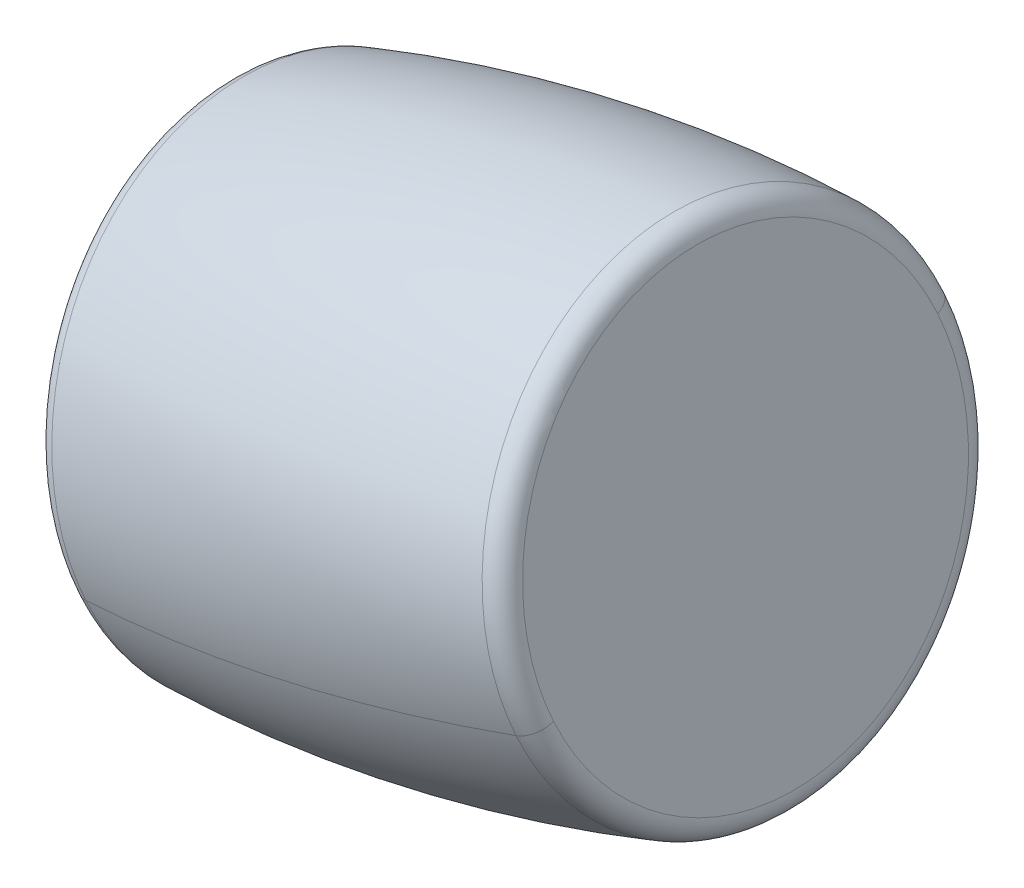
ISO-10303-21;
HEADER;
FILE_DESCRIPTION(('STEP AP214'),'2;1');
FILE_NAME('part.step','',(''),(''),'','','');
FILE_SCHEMA(('AUTOMOTIVE_DESIGN { 1 0 10303 214 1 1 1 1 }'));
ENDSEC;
DATA;
#1=APPLICATION_CONTEXT('core data for automotive mechanical design processes');
#2=APPLICATION_PROTOCOL_DEFINITION('international standard','automotive_design',2000,#1);
#3=PRODUCT_CONTEXT('',#1,'mechanical');
#4=PRODUCT('Part','Part','',(#3));
#5=PRODUCT_RELATED_PRODUCT_CATEGORY('part','',(#4));
#6=PRODUCT_DEFINITION_FORMATION('','',#4);
#7=PRODUCT_DEFINITION_CONTEXT('part definition',#1,'design');
#8=PRODUCT_DEFINITION('design','',#6,#7);
#9=PRODUCT_DEFINITION_SHAPE('','',#8);
#10=(LENGTH_UNIT() NAMED_UNIT(*) SI_UNIT(.MILLI.,.METRE.));
#11=(NAMED_UNIT(*) PLANE_ANGLE_UNIT() SI_UNIT($,.RADIAN.));
#12=(NAMED_UNIT(*) SI_UNIT($,.STERADIAN.) SOLID_ANGLE_UNIT());
#13=UNCERTAINTY_MEASURE_WITH_UNIT(LENGTH_MEASURE(1.E-05),#10,'distance_accuracy_value','');
#14=(GEOMETRIC_REPRESENTATION_CONTEXT(3) GLOBAL_UNCERTAINTY_ASSIGNED_CONTEXT((#13)) GLOBAL_UNIT_ASSIGNED_CONTEXT((#10,
#11,#12)) REPRESENTATION_CONTEXT('',''));
#15=CARTESIAN_POINT('',(0.,0.,0.));
#16=DIRECTION('',(0.,0.,1.));
#17=DIRECTION('',(1.,0.,0.));
#18=AXIS2_PLACEMENT_3D('',#15,#16,#17);
#19=CARTESIAN_POINT('',(5.41216295752265,92.374599006154,0.));
#20=DIRECTION('',(0.975020426816809,0.222115211748245,0.));
#21=DIRECTION('',(-0.222115211748245,0.975020426816809,0.));
#22=AXIS2_PLACEMENT_3D('',#19,#20,#21);
#23=PLANE('',#22);
#24=CARTESIAN_POINT('',(6.44112984304528,87.8577371307061,14.2576207137991));
#25=CARTESIAN_POINT('',(6.49294745993183,87.6302730388247,14.1818251436068));
#26=CARTESIAN_POINT('',(6.54435105352382,87.4046263873887,14.1002941965974));
#27=CARTESIAN_POINT('',(6.64620816349415,86.9575036439444,13.9259793446168));
#28=CARTESIAN_POINT('',(6.69666167987248,86.7360275519361,13.8331954396454));
#29=CARTESIAN_POINT('',(6.79649660479089,86.2977816058839,13.6365924674124));
#30=CARTESIAN_POINT('',(6.84587801333098,86.0810117518402,13.5327734001508));
#31=CARTESIAN_POINT('',(6.94344988803728,85.652699930364,13.3143517476132));
#32=CARTESIAN_POINT('',(6.99164035420349,85.4411579629316,13.1997491623373));
#33=CARTESIAN_POINT('',(7.08671421438109,85.0238116902479,12.9600361501216));
#34=CARTESIAN_POINT('',(7.13359760839247,84.8180073849966,12.834925723182));
#35=CARTESIAN_POINT('',(7.22594438736281,84.4126321964261,12.5744985398274));
#36=CARTESIAN_POINT('',(7.27140777232175,84.213061313107,12.4391817834126));
#37=CARTESIAN_POINT('',(7.36080500541744,83.820633763084,12.1586679014951));
#38=CARTESIAN_POINT('',(7.40473885355418,83.6277770963802,12.0134707759924));
#39=CARTESIAN_POINT('',(7.4909711731852,83.2492425852574,11.7135459564053));
#40=CARTESIAN_POINT('',(7.53326964467949,83.0635647408386,11.5588182623209));
#41=CARTESIAN_POINT('',(7.61612931012387,82.6998351892622,11.2402050560175));
#42=CARTESIAN_POINT('',(7.65669050407397,82.5217834821047,11.0763195437985));
#43=CARTESIAN_POINT('',(7.73597789900895,82.1737351469987,10.7397855163479));
#44=CARTESIAN_POINT('',(7.77470409999385,82.0037385190501,10.5671370011162));
#45=CARTESIAN_POINT('',(7.8502282141754,81.6722098791849,10.2134928928833));
#46=CARTESIAN_POINT('',(7.88702612737205,81.5106778672684,10.0324972998821));
#47=CARTESIAN_POINT('',(7.95860501658456,81.1964676042173,9.6625950703877));
#48=CARTESIAN_POINT('',(7.99338599260042,81.0437893530828,9.47368843389457));
#49=CARTESIAN_POINT('',(8.06084721703273,80.7476544268801,9.08841921003909));
#50=CARTESIAN_POINT('',(8.09352746544919,80.6041977518118,8.89205662267673));
#51=CARTESIAN_POINT('',(8.15670850510206,80.3268515774359,8.49234855175799));
#52=CARTESIAN_POINT('',(8.18720929633847,80.1929620781282,8.28900306820161));
#53=CARTESIAN_POINT('',(8.24595794255356,79.9350728068051,7.87581908197489));
#54=CARTESIAN_POINT('',(8.27420579753223,79.8110730347896,7.66598057930456));
#55=CARTESIAN_POINT('',(8.32838051967497,79.5732619443625,7.24031607418276));
#56=CARTESIAN_POINT('',(8.35430738683905,79.4594506259509,7.02449007173129));
#57=CARTESIAN_POINT('',(8.40377767325868,79.2422906241663,6.5873705107912));
#58=CARTESIAN_POINT('',(8.42732109251423,79.1389419407934,6.36607695230258));
#59=CARTESIAN_POINT('',(8.47196776495767,78.9429561851168,5.91855539485362));
#60=CARTESIAN_POINT('',(8.49307101814555,78.8503191128131,5.69232739589328));
#61=CARTESIAN_POINT('',(8.5327865188683,78.6759797500961,5.23548196056561));
#62=CARTESIAN_POINT('',(8.55139876640316,78.5942774596829,5.00486452419828));
#63=CARTESIAN_POINT('',(8.58608741728531,78.4420044887206,4.53979579166054));
#64=CARTESIAN_POINT('',(8.6021638206326,78.3714338081717,4.30534449549013));
#65=CARTESIAN_POINT('',(8.6317420536758,78.2415940678888,3.83317285705422));
#66=CARTESIAN_POINT('',(8.64524388337172,78.1823250081548,3.59545251478871));
#67=CARTESIAN_POINT('',(8.66964044202184,78.0752312938582,3.11731547328896));
#68=CARTESIAN_POINT('',(8.68053517097603,78.0274066392955,2.87689877405471));
#69=CARTESIAN_POINT('',(8.69969128178638,77.9433169491233,2.39394820350396));
#70=CARTESIAN_POINT('',(8.70795266364254,77.9070519135137,2.15141433218745));
#71=CARTESIAN_POINT('',(8.72182217786431,77.8461688268948,1.66481370281162));
#72=CARTESIAN_POINT('',(8.72743031022992,77.8215507758854,1.4207469447523));
#73=CARTESIAN_POINT('',(8.73597981498852,77.7840209655082,0.931668520088751));
#74=CARTESIAN_POINT('',(8.7389211873815,77.7711092061404,0.686656853484513));
#75=CARTESIAN_POINT('',(8.74213008617112,77.7570230846053,0.196278866296461));
#76=CARTESIAN_POINT('',(8.74239761256775,77.7558487224382,-0.0490874542873532));
#77=CARTESIAN_POINT('',(8.74025817487014,77.7652402244459,-0.539583640476731));
#78=CARTESIAN_POINT('',(8.73785121077589,77.7758060886208,-0.784713506082293));
#79=CARTESIAN_POINT('',(8.73036859068385,77.8086525892203,-1.27414624299807));
#80=CARTESIAN_POINT('',(8.72529293468605,77.8309332256449,-1.51844911430829));
#81=CARTESIAN_POINT('',(8.71248515848679,77.8871555947393,-2.005639315618));
#82=CARTESIAN_POINT('',(8.70475303828532,77.921097327409,-2.24852664561749));
#83=CARTESIAN_POINT('',(8.68665096103352,78.0005601203866,-2.73230062745336));
#84=CARTESIAN_POINT('',(8.67628100398319,78.0460811806944,-2.97318727928973));
#85=CARTESIAN_POINT('',(8.65292823516852,78.1485929647268,-3.4523795877559));
#86=CARTESIAN_POINT('',(8.63994542340417,78.2055836884513,-3.69068524438569));
#87=CARTESIAN_POINT('',(8.61139822189216,78.3308975036717,-4.16414146323879));
#88=CARTESIAN_POINT('',(8.59583383214449,78.3992205951676,-4.3992920254621));
#89=CARTESIAN_POINT('',(8.56216097064402,78.5470345496191,-4.86587155720104));
#90=CARTESIAN_POINT('',(8.54405249889121,78.6265254125747,-5.09730052671669));
#91=CARTESIAN_POINT('',(8.50533509827502,78.7964834094939,-5.55587934038198));
#92=CARTESIAN_POINT('',(8.48472616941165,78.8869505434577,-5.78302918453162));
#93=CARTESIAN_POINT('',(8.44105750328908,79.0786431391436,-6.23250252359438));
#94=CARTESIAN_POINT('',(8.41799776602989,79.1798686008657,-6.45482601850749));
#95=CARTESIAN_POINT('',(8.36948303604255,79.392833991065,-6.89411106232469));
#96=CARTESIAN_POINT('',(8.34402804331441,79.5045739195421,-7.11107261122878));
#97=CARTESIAN_POINT('',(8.29078412569623,79.7382990519761,-7.53911108365306));
#98=CARTESIAN_POINT('',(8.26299520080619,79.8602842559331,-7.75018800717323));
#99=CARTESIAN_POINT('',(8.20515036481833,80.114206066286,-8.16594872603276));
#100=CARTESIAN_POINT('',(8.1750944537205,80.2461426726819,-8.37063252137211));
#101=CARTESIAN_POINT('',(8.11278805263946,80.5196494410716,-8.77311388267882));
#102=CARTESIAN_POINT('',(8.08053756265625,80.6612196030654,-8.97091144864618));
#103=CARTESIAN_POINT('',(8.01391969805963,80.9536524277305,-9.35914383954748));
#104=CARTESIAN_POINT('',(7.97955232344622,81.1045150904018,-9.54957866448142));
#105=CARTESIAN_POINT('',(7.90878348360488,81.4151694750535,-9.92262679914249));
#106=CARTESIAN_POINT('',(7.87238201837694,81.574961197034,-10.1052401088696));
#107=CARTESIAN_POINT('',(7.79763269162465,81.9030887480497,-10.4622052816589));
#108=CARTESIAN_POINT('',(7.75928483010031,82.0714245770849,-10.6365571447211));
#109=CARTESIAN_POINT('',(7.68073509411251,82.4162348064535,-10.9765793952709));
#110=CARTESIAN_POINT('',(7.64053321964905,82.5927092067869,-11.1422497827585));
#111=CARTESIAN_POINT('',(7.55837230761987,82.9533714364641,-11.4645099676848));
#112=CARTESIAN_POINT('',(7.51641327005414,83.137559265808,-11.6210997651234));
#113=CARTESIAN_POINT('',(7.4308391148171,83.5132046288922,-11.9248215314141));
#114=CARTESIAN_POINT('',(7.38722399714579,83.7046621626326,-12.0719535002661));
#115=CARTESIAN_POINT('',(7.29844275433627,84.0943856965416,-12.3564051555832));
#116=CARTESIAN_POINT('',(7.25327662919807,84.2926516967101,-12.4937248420483));
#117=CARTESIAN_POINT('',(7.16150218060632,84.6955145233149,-12.7582211174393));
#118=CARTESIAN_POINT('',(7.11489385715277,84.9001113497511,-12.8853977063651));
#119=CARTESIAN_POINT('',(7.02034729546393,85.3151429372157,-13.1293014071352));
#120=CARTESIAN_POINT('',(6.97240905722864,85.5255776982441,-13.2460285189796));
#121=CARTESIAN_POINT('',(6.87531815339114,85.9517781991218,-13.4687520597504));
#122=CARTESIAN_POINT('',(6.82616548778891,86.1675439389712,-13.5747484886768));
#123=CARTESIAN_POINT('',(6.72676414229423,86.6038865989249,-13.7757553089303));
#124=CARTESIAN_POINT('',(6.67651546240177,86.8244635190291,-13.8707657002574));
#125=CARTESIAN_POINT('',(6.57504314179775,87.2698971503715,-14.0495715569573));
#126=CARTESIAN_POINT('',(6.5238195010862,87.4947538616098,-14.1333670223301));
#127=CARTESIAN_POINT('',(6.42052066108107,87.948205375708,-14.2895411565067));
#128=CARTESIAN_POINT('',(6.36844546178749,88.1768001785679,-14.3619198253104));
#129=CARTESIAN_POINT('',(6.26356895833487,88.6371771710062,-14.495085999793));
#130=CARTESIAN_POINT('',(6.21076765417582,88.8689593605844,-14.5558735054718));
#131=CARTESIAN_POINT('',(6.10456614395811,89.3351527428658,-14.6657109112904));
#132=CARTESIAN_POINT('',(6.05116593789946,89.5695639355689,-14.71476081143));
#133=CARTESIAN_POINT('',(5.9438952696588,90.0404506069936,-14.8010048406224));
#134=CARTESIAN_POINT('',(5.89002480747679,90.2769260857153,-14.8381989696752));
#135=CARTESIAN_POINT('',(5.78194340564183,90.7513716390775,-14.9006418529361));
#136=CARTESIAN_POINT('',(5.72773246598888,90.9893417137182,-14.9258906071443));
#137=CARTESIAN_POINT('',(5.61910070814935,91.4662031680099,-14.9643819136692));
#138=CARTESIAN_POINT('',(5.56467988996276,91.7050945476608,-14.9776244659859));
#139=CARTESIAN_POINT('',(5.45575947944169,92.1832231022944,-14.9920714684485));
#140=CARTESIAN_POINT('',(5.4012598871072,92.422460277277,-14.9932759185943));
#141=CARTESIAN_POINT('',(5.29231322307442,92.9007040771024,-14.9836438069197));
#142=CARTESIAN_POINT('',(5.23786615137614,93.1397107019452,-14.9728072450992));
#143=CARTESIAN_POINT('',(5.12915569454215,93.616917621667,-14.9391192462076));
#144=CARTESIAN_POINT('',(5.07489230940644,93.855117916546,-14.9162678091365));
#145=CARTESIAN_POINT('',(4.96667995780615,94.3301383008489,-14.8586049970701));
#146=CARTESIAN_POINT('',(4.91273099134156,94.5669583902728,-14.8237936220748));
#147=CARTESIAN_POINT('',(4.80527741926409,95.0386479557255,-14.7422952224707));
#148=CARTESIAN_POINT('',(4.75177281365122,95.2735174317542,-14.6956081978619));
#149=CARTESIAN_POINT('',(4.64533695611764,95.7407395298005,-14.5904693873124));
#150=CARTESIAN_POINT('',(4.59240570419693,95.973092151818,-14.5320176013717));
#151=CARTESIAN_POINT('',(4.48724371343849,96.43472234953,-14.4034959983713));
#152=CARTESIAN_POINT('',(4.43501297460076,96.6639999252246,-14.3334261813117));
#153=CARTESIAN_POINT('',(4.38319607199993,96.8914608816018,-14.2576207137991));
#154=B_SPLINE_CURVE_WITH_KNOTS('',3,(#24,#25,#26,#27,#28,#29,#30,#31,#32,#33,#34,#35,#36,#37,
#38,#39,#40,#41,#42,#43,#44,#45,#46,#47,#48,#49,#50,#51,#52,#53,#54,#55,#56,#57,#58,#59,#60,#61,
#62,#63,#64,#65,#66,#67,#68,#69,#70,#71,#72,#73,#74,#75,#76,#77,#78,#79,#80,#81,#82,#83,#84,#85,
#86,#87,#88,#89,#90,#91,#92,#93,#94,#95,#96,#97,#98,#99,#100,#101,#102,#103,#104,#105,#106,#107,
#108,#109,#110,#111,#112,#113,#114,#115,#116,#117,#118,#119,#120,#121,#122,#123,#124,#125,#126,
#127,#128,#129,#130,#131,#132,#133,#134,#135,#136,#137,#138,#139,#140,#141,#142,#143,#144,#145,
#146,#147,#148,#149,#150,#151,#152,#153),.UNSPECIFIED.,.F.,.F.,(4,2,2,2,2,2,2,2,2,2,2,2,2,2,2,2,
2,2,2,2,2,2,2,2,2,2,2,2,2,2,2,2,2,2,2,2,2,2,2,2,2,2,2,2,2,2,2,2,2,2,2,2,2,2,2,2,2,2,2,2,2,2,2,2,
4),(0.,0.735812272215711,1.47162454443143,2.20743681664715,2.94324908886287,3.67906136107858,
4.4148736332943,5.15068590551002,5.88649817772574,6.62231044994146,7.35812272215718,
8.0939349943729,8.82974726658862,9.56555953880433,10.3013718110201,11.0371840832358,
11.7729963554515,12.5088086276672,13.2446208998829,13.9804331720987,14.7162454443144,
15.4520577165301,16.1878699887458,16.9236822609615,17.6594945331772,18.395306805393,
19.1311190776087,19.8669313498244,20.6027436220401,21.3385558942558,22.0743681664716,
22.8101804386873,23.545992710903,24.2818049831187,25.0176172553344,25.7534295275501,
26.4892417997659,27.2250540719816,27.9608663441973,28.696678616413,29.4324908886287,
30.1683031608445,30.9041154330602,31.6399277052759,32.3757399774916,33.1115522497073,
33.8473645219231,34.5831767941388,35.3189890663545,36.0548013385702,36.7906136107859,
37.5264258830016,38.2622381552174,38.9980504274331,39.7338626996488,40.4696749718645,
41.2054872440802,41.9412995162959,42.6771117885116,43.4129240607274,44.1487363329431,
44.8845486051588,45.6203608773745,46.3561731495902,47.091985421806),.UNSPECIFIED.);
#155=CARTESIAN_POINT('',(6.44112984304528,87.8577371307061,14.2576207137991));
#156=VERTEX_POINT('',#155);
#157=CARTESIAN_POINT('',(4.38319607199992,96.8914608816019,-14.2576207137991));
#158=VERTEX_POINT('',#157);
#159=EDGE_CURVE('E11',#156,#158,#154,.T.);
#160=ORIENTED_EDGE('',*,*,#159,.F.);
#161=CARTESIAN_POINT('',(4.38319607199992,96.8914608816019,-14.2576207137991));
#162=CARTESIAN_POINT('',(4.33137845511338,97.1189249734832,-14.1818251436068));
#163=CARTESIAN_POINT('',(4.27997486152138,97.3445716249192,-14.1002941965974));
#164=CARTESIAN_POINT('',(4.17811775155105,97.7916943683636,-13.9259793446168));
#165=CARTESIAN_POINT('',(4.12766423517272,98.0131704603719,-13.8331954396454));
#166=CARTESIAN_POINT('',(4.02782931025431,98.451416406424,-13.6365924674124));
#167=CARTESIAN_POINT('',(3.97844790171422,98.6681862604678,-13.5327734001508));
#168=CARTESIAN_POINT('',(3.88087602700793,99.0964980819439,-13.3143517476132));
#169=CARTESIAN_POINT('',(3.83268556084171,99.3080400493763,-13.1997491623372));
#170=CARTESIAN_POINT('',(3.73761170066411,99.72538632206,-12.9600361501216));
#171=CARTESIAN_POINT('',(3.69072830665273,99.9311906273114,-12.834925723182));
#172=CARTESIAN_POINT('',(3.59838152768239,100.336565815882,-12.5744985398274));
#173=CARTESIAN_POINT('',(3.55291814272345,100.536136699201,-12.4391817834126));
#174=CARTESIAN_POINT('',(3.46352090962776,100.928564249224,-12.1586679014951));
#175=CARTESIAN_POINT('',(3.41958706149102,101.121420915928,-12.0134707759924));
#176=CARTESIAN_POINT('',(3.33335474186,101.499955427051,-11.7135459564053));
#177=CARTESIAN_POINT('',(3.29105627036571,101.685633271469,-11.5588182623209));
#178=CARTESIAN_POINT('',(3.20819660492133,102.049362823046,-11.2402050560175));
#179=CARTESIAN_POINT('',(3.16763541097124,102.227414530203,-11.0763195437985));
#180=CARTESIAN_POINT('',(3.08834801603625,102.575462865309,-10.7397855163479));
#181=CARTESIAN_POINT('',(3.04962181505135,102.745459493258,-10.5671370011162));
#182=CARTESIAN_POINT('',(2.9740977008698,103.076988133123,-10.2134928928833));
#183=CARTESIAN_POINT('',(2.93729978767315,103.23852014504,-10.0324972998821));
#184=CARTESIAN_POINT('',(2.86572089846064,103.552730408091,-9.6625950703877));
#185=CARTESIAN_POINT('',(2.83093992244478,103.705408659225,-9.47368843389458));
#186=CARTESIAN_POINT('',(2.76347869801247,104.001543585428,-9.08841921003909));
#187=CARTESIAN_POINT('',(2.73079844959601,104.145000260496,-8.89205662267673));
#188=CARTESIAN_POINT('',(2.66761740994314,104.422346434872,-8.49234855175799));
#189=CARTESIAN_POINT('',(2.63711661870672,104.55623593418,-8.28900306820162));
#190=CARTESIAN_POINT('',(2.57836797249164,104.814125205503,-7.8758190819749));
#191=CARTESIAN_POINT('',(2.55012011751297,104.938124977518,-7.66598057930457));
#192=CARTESIAN_POINT('',(2.49594539537023,105.175936067946,-7.24031607418277));
#193=CARTESIAN_POINT('',(2.47001852820615,105.289747386357,-7.0244900717313));
#194=CARTESIAN_POINT('',(2.42054824178652,105.506907388142,-6.58737051079121));
#195=CARTESIAN_POINT('',(2.39700482253097,105.610256071515,-6.36607695230259));
#196=CARTESIAN_POINT('',(2.35235815008753,105.806241827191,-5.91855539485362));
#197=CARTESIAN_POINT('',(2.33125489689965,105.898878899495,-5.69232739589329));
#198=CARTESIAN_POINT('',(2.2915393961769,106.073218262212,-5.23548196056562));
#199=CARTESIAN_POINT('',(2.27292714864204,106.154920552625,-5.00486452419829));
#200=CARTESIAN_POINT('',(2.23823849775989,106.307193523587,-4.53979579166055));
#201=CARTESIAN_POINT('',(2.2221620944126,106.377764204136,-4.30534449549015));
#202=CARTESIAN_POINT('',(2.1925838613694,106.507603944419,-3.83317285705423));
#203=CARTESIAN_POINT('',(2.17908203167348,106.566873004153,-3.59545251478872));
#204=CARTESIAN_POINT('',(2.15468547302336,106.67396671845,-3.11731547328897));
#205=CARTESIAN_POINT('',(2.14379074406917,106.721791373012,-2.87689877405473));
#206=CARTESIAN_POINT('',(2.12463463325882,106.805881063185,-2.39394820350397));
#207=CARTESIAN_POINT('',(2.11637325140266,106.842146098794,-2.15141433218746));
#208=CARTESIAN_POINT('',(2.10250373718089,106.903029185413,-1.66481370281164));
#209=CARTESIAN_POINT('',(2.09689560481528,106.927647236423,-1.42074694475232));
#210=CARTESIAN_POINT('',(2.08834610005668,106.9651770468,-0.931668520088765));
#211=CARTESIAN_POINT('',(2.0854047276637,106.978088806168,-0.686656853484527));
#212=CARTESIAN_POINT('',(2.08219582887408,106.992174927703,-0.196278866296472));
#213=CARTESIAN_POINT('',(2.08192830247745,106.99334928987,0.049087454287344));
#214=CARTESIAN_POINT('',(2.08406774017507,106.983957787862,0.539583640476721));
#215=CARTESIAN_POINT('',(2.08647470426931,106.973391923687,0.784713506082281));
#216=CARTESIAN_POINT('',(2.09395732436135,106.940545423088,1.27414624299806));
#217=CARTESIAN_POINT('',(2.09903298035915,106.918264786663,1.51844911430828));
#218=CARTESIAN_POINT('',(2.11184075655841,106.862042417569,2.00563931561799));
#219=CARTESIAN_POINT('',(2.11957287675988,106.828100684899,2.24852664561747));
#220=CARTESIAN_POINT('',(2.13767495401168,106.748637891921,2.73230062745333));
#221=CARTESIAN_POINT('',(2.14804491106201,106.703116831614,2.97318727928971));
#222=CARTESIAN_POINT('',(2.17139767987668,106.600605047581,3.45237958775588));
#223=CARTESIAN_POINT('',(2.18438049164102,106.543614323857,3.69068524438568));
#224=CARTESIAN_POINT('',(2.21292769315304,106.418300508636,4.16414146323878));
#225=CARTESIAN_POINT('',(2.22849208290071,106.34997741714,4.39929202546208));
#226=CARTESIAN_POINT('',(2.26216494440118,106.202163462689,4.86587155720103));
#227=CARTESIAN_POINT('',(2.28027341615399,106.122672599733,5.09730052671667));
#228=CARTESIAN_POINT('',(2.31899081677017,105.952714602814,5.55587934038196));
#229=CARTESIAN_POINT('',(2.33959974563355,105.86224746885,5.78302918453161));
#230=CARTESIAN_POINT('',(2.38326841175612,105.670554873164,6.23250252359436));
#231=CARTESIAN_POINT('',(2.40632814901531,105.569329411442,6.45482601850748));
#232=CARTESIAN_POINT('',(2.45484287900264,105.356364021243,6.89411106232468));
#233=CARTESIAN_POINT('',(2.48029787173079,105.244624092766,7.11107261122877));
#234=CARTESIAN_POINT('',(2.53354178934897,105.010898960332,7.53911108365304));
#235=CARTESIAN_POINT('',(2.561330714239,104.888913756375,7.75018800717322));
#236=CARTESIAN_POINT('',(2.61917555022686,104.634991946022,8.16594872603274));
#237=CARTESIAN_POINT('',(2.64923146132469,104.503055339626,8.37063252137209));
#238=CARTESIAN_POINT('',(2.71153786240573,104.229548571236,8.7731138826788));
#239=CARTESIAN_POINT('',(2.74378835238894,104.087978409243,8.97091144864616));
#240=CARTESIAN_POINT('',(2.81040621698556,103.795545584577,9.35914383954746));
#241=CARTESIAN_POINT('',(2.84477359159897,103.644682921906,9.5495786644814));
#242=CARTESIAN_POINT('',(2.91554243144032,103.334028537254,9.92262679914247));
#243=CARTESIAN_POINT('',(2.95194389666826,103.174236815274,10.1052401088696));
#244=CARTESIAN_POINT('',(3.02669322342054,102.846109264258,10.4622052816589));
#245=CARTESIAN_POINT('',(3.06504108494489,102.677773435223,10.636557144721));
#246=CARTESIAN_POINT('',(3.14359082093269,102.332963205854,10.9765793952708));
#247=CARTESIAN_POINT('',(3.18379269539615,102.156488805521,11.1422497827585));
#248=CARTESIAN_POINT('',(3.26595360742533,101.795826575844,11.4645099676848));
#249=CARTESIAN_POINT('',(3.30791264499105,101.6116387465,11.6210997651234));
#250=CARTESIAN_POINT('',(3.39348680022809,101.235993383416,11.9248215314141));
#251=CARTESIAN_POINT('',(3.43710191789941,101.044535849675,12.0719535002661));
#252=CARTESIAN_POINT('',(3.52588316070892,100.654812315766,12.3564051555832));
#253=CARTESIAN_POINT('',(3.57104928584713,100.456546315598,12.4937248420483));
#254=CARTESIAN_POINT('',(3.66282373443888,100.053683488993,12.7582211174393));
#255=CARTESIAN_POINT('',(3.70943205789243,99.8490866625569,12.885397706365));
#256=CARTESIAN_POINT('',(3.80397861958126,99.4340550750923,13.1293014071352));
#257=CARTESIAN_POINT('',(3.85191685781655,99.2236203140639,13.2460285189796));
#258=CARTESIAN_POINT('',(3.94900776165406,98.7974198131861,13.4687520597504));
#259=CARTESIAN_POINT('',(3.99816042725628,98.5816540733368,13.5747484886768));
#260=CARTESIAN_POINT('',(4.09756177275096,98.1453114133831,13.7757553089303));
#261=CARTESIAN_POINT('',(4.14781045264342,97.9247344932789,13.8707657002574));
#262=CARTESIAN_POINT('',(4.24928277324744,97.4793008619364,14.0495715569573));
#263=CARTESIAN_POINT('',(4.300506413959,97.2544441506982,14.1333670223301));
#264=CARTESIAN_POINT('',(4.40380525396413,96.8009926366,14.2895411565067));
#265=CARTESIAN_POINT('',(4.4558804532577,96.57239783374,14.3619198253104));
#266=CARTESIAN_POINT('',(4.56075695671032,96.1120208413018,14.495085999793));
#267=CARTESIAN_POINT('',(4.61355826086938,95.8802386517236,14.5558735054718));
#268=CARTESIAN_POINT('',(4.71975977108709,95.4140452694422,14.6657109112904));
#269=CARTESIAN_POINT('',(4.77315997714574,95.1796340767391,14.71476081143));
#270=CARTESIAN_POINT('',(4.8804306453864,94.7087474053143,14.8010048406224));
#271=CARTESIAN_POINT('',(4.93430110756841,94.4722719265927,14.8381989696751));
#272=CARTESIAN_POINT('',(5.04238250940336,93.9978263732304,14.9006418529361));
#273=CARTESIAN_POINT('',(5.09659344905631,93.7598562985897,14.9258906071443));
#274=CARTESIAN_POINT('',(5.20522520689584,93.2829948442981,14.9643819136692));
#275=CARTESIAN_POINT('',(5.25964602508243,93.0441034646472,14.9776244659859));
#276=CARTESIAN_POINT('',(5.36856643560351,92.5659749100136,14.9920714684485));
#277=CARTESIAN_POINT('',(5.423066027938,92.3267377350309,14.9932759185943));
#278=CARTESIAN_POINT('',(5.53201269197077,91.8484939352055,14.9836438069197));
#279=CARTESIAN_POINT('',(5.58645976366905,91.6094873103628,14.9728072450992));
#280=CARTESIAN_POINT('',(5.69517022050304,91.132280390641,14.9391192462076));
#281=CARTESIAN_POINT('',(5.74943360563875,90.894080095762,14.9162678091365));
#282=CARTESIAN_POINT('',(5.85764595723905,90.4190597114591,14.8586049970701));
#283=CARTESIAN_POINT('',(5.91159492370364,90.1822396220352,14.8237936220748));
#284=CARTESIAN_POINT('',(6.0190484957811,89.7105500565825,14.7422952224707));
#285=CARTESIAN_POINT('',(6.07255310139397,89.4756805805538,14.6956081978619));
#286=CARTESIAN_POINT('',(6.17898895892755,89.0084584825075,14.5904693873124));
#287=CARTESIAN_POINT('',(6.23192021084826,88.77610586049,14.5320176013717));
#288=CARTESIAN_POINT('',(6.3370822016067,88.314475662778,14.4034959983713));
#289=CARTESIAN_POINT('',(6.38931294044443,88.0851980870834,14.3334261813117));
#290=CARTESIAN_POINT('',(6.44112984304526,87.8577371307061,14.2576207137991));
#291=B_SPLINE_CURVE_WITH_KNOTS('',3,(#161,#162,#163,#164,#165,#166,#167,#168,#169,#170,#171,
#172,#173,#174,#175,#176,#177,#178,#179,#180,#181,#182,#183,#184,#185,#186,#187,#188,#189,#190,
#191,#192,#193,#194,#195,#196,#197,#198,#199,#200,#201,#202,#203,#204,#205,#206,#207,#208,#209,
#210,#211,#212,#213,#214,#215,#216,#217,#218,#219,#220,#221,#222,#223,#224,#225,#226,#227,#228,
#229,#230,#231,#232,#233,#234,#235,#236,#237,#238,#239,#240,#241,#242,#243,#244,#245,#246,#247,
#248,#249,#250,#251,#252,#253,#254,#255,#256,#257,#258,#259,#260,#261,#262,#263,#264,#265,#266,
#267,#268,#269,#270,#271,#272,#273,#274,#275,#276,#277,#278,#279,#280,#281,#282,#283,#284,#285,
#286,#287,#288,#289,#290),.UNSPECIFIED.,.F.,.F.,(4,2,2,2,2,2,2,2,2,2,2,2,2,2,2,2,2,2,2,2,2,2,2,
2,2,2,2,2,2,2,2,2,2,2,2,2,2,2,2,2,2,2,2,2,2,2,2,2,2,2,2,2,2,2,2,2,2,2,2,2,2,2,2,2,4),(0.,
0.735812272215724,1.47162454443143,2.20743681664716,2.94324908886287,3.67906136107859,
4.41487363329431,5.15068590551003,5.88649817772575,6.62231044994147,7.35812272215718,
8.0939349943729,8.82974726658862,9.56555953880433,10.3013718110201,11.0371840832358,
11.7729963554515,12.5088086276672,13.2446208998829,13.9804331720986,14.7162454443144,
15.4520577165301,16.1878699887458,16.9236822609615,17.6594945331772,18.395306805393,
19.1311190776087,19.8669313498244,20.6027436220401,21.3385558942558,22.0743681664715,
22.8101804386873,23.545992710903,24.2818049831187,25.0176172553344,25.7534295275501,
26.4892417997659,27.2250540719816,27.9608663441973,28.696678616413,29.4324908886287,
30.1683031608444,30.9041154330602,31.6399277052759,32.3757399774916,33.1115522497073,
33.847364521923,34.5831767941388,35.3189890663545,36.0548013385702,36.7906136107859,
37.5264258830016,38.2622381552173,38.9980504274331,39.7338626996488,40.4696749718645,
41.2054872440802,41.9412995162959,42.6771117885116,43.4129240607273,44.1487363329431,
44.8845486051588,45.6203608773745,46.3561731495902,47.0919854218059),.UNSPECIFIED.);
#292=EDGE_CURVE('E26',#158,#156,#291,.T.);
#293=ORIENTED_EDGE('',*,*,#292,.F.);
#294=EDGE_LOOP('',(#160,#293));
#295=FACE_BOUND('',#294,.T.);
#296=ADVANCED_FACE('F17',(#295),#23,.F.);
#297=CARTESIAN_POINT('',(6.87469359774891,92.7077718237766,0.));
#298=DIRECTION('',(0.975020426816809,0.222115211748245,0.));
#299=DIRECTION('',(0.211244119501446,-0.927299530445008,-0.309016994374947));
#300=AXIS2_PLACEMENT_3D('',#297,#298,#299);
#301=TOROIDAL_SURFACE('',#300,14.9913495880768,1.50000000000113);
#302=CARTESIAN_POINT('',(5.84572671222623,97.2246336992245,-14.2576207137991));
#303=DIRECTION('',(-0.211244119501447,0.927299530445008,0.309016994374946));
#304=DIRECTION('',(-0.198556513350396,0.268848322363584,-0.942494504264306));
#305=AXIS2_PLACEMENT_3D('',#302,#303,#304);
#306=CIRCLE('',#305,1.50000000000112);
#307=CARTESIAN_POINT('',(5.54789194220041,97.6279061827702,-15.6713624701966));
#308=VERTEX_POINT('',#307);
#309=EDGE_CURVE('E104',#308,#158,#306,.T.);
#310=ORIENTED_EDGE('',*,*,#309,.T.);
#311=ORIENTED_EDGE('',*,*,#292,.T.);
#312=CARTESIAN_POINT('',(7.90366048327159,88.1909099483287,14.2576207137991));
#313=DIRECTION('',(0.211244119501446,-0.927299530445008,-0.309016994374947));
#314=DIRECTION('',(-0.0625175971606157,-0.328322493102197,0.942494504264306));
#315=AXIS2_PLACEMENT_3D('',#312,#313,#314);
#316=CIRCLE('',#315,1.50000000000112);
#317=CARTESIAN_POINT('',(7.8098840875306,87.698426208675,15.6713624701966));
#318=VERTEX_POINT('',#317);
#319=EDGE_CURVE('E100',#318,#156,#316,.T.);
#320=ORIENTED_EDGE('',*,*,#319,.F.);
#321=CARTESIAN_POINT('',(6.67888801486552,92.6631661957226,0.));
#322=DIRECTION('',(0.975020426816809,0.222115211748245,0.));
#323=DIRECTION('',(-0.0686373751393976,0.301297881749108,-0.951056516295154));
#324=AXIS2_PLACEMENT_3D('',#321,#322,#323);
#325=CIRCLE('',#324,16.477845639757);
#326=EDGE_CURVE('E95',#308,#318,#325,.T.);
#327=ORIENTED_EDGE('',*,*,#326,.F.);
#328=EDGE_LOOP('',(#310,#311,#320,#327));
#329=FACE_BOUND('',#328,.T.);
#330=ADVANCED_FACE('F111',(#329),#301,.T.);
#331=CARTESIAN_POINT('',(21.4999999999824,96.039499999996,0.));
#332=DIRECTION('',(0.975020426816809,0.222115211748245,0.));
#333=DIRECTION('',(0.211244119501446,-0.927299530445008,-0.309016994374947));
#334=AXIS2_PLACEMENT_3D('',#331,#332,#333);
#335=DEGENERATE_TOROIDAL_SURFACE('',#334,96.0395000003661,113.539500000362,.F.);
#336=CARTESIAN_POINT('',(28.0918991897077,67.1030020856423,91.3389922970766));
#337=DIRECTION('',(-0.211244119501446,0.927299530445008,0.309016994374947));
#338=DIRECTION('',(0.0625175971599151,0.328322493102068,-0.942494504264398));
#339=AXIS2_PLACEMENT_3D('',#336,#337,#338);
#340=CIRCLE('',#339,113.539500000362);
#341=CARTESIAN_POINT('',(35.1901159124686,104.380573791323,-15.6713624701922));
#342=VERTEX_POINT('',#341);
#343=EDGE_CURVE('E90',#342,#308,#340,.T.);
#344=ORIENTED_EDGE('',*,*,#343,.T.);
#345=ORIENTED_EDGE('',*,*,#326,.T.);
#346=CARTESIAN_POINT('',(14.9081008102571,124.97599791435,-91.3389922970766));
#347=DIRECTION('',(0.211244119501446,-0.927299530445008,-0.309016994374947));
#348=DIRECTION('',(0.198556513349708,-0.268848322363772,0.942494504264398));
#349=AXIS2_PLACEMENT_3D('',#346,#347,#348);
#350=CIRCLE('',#349,113.539500000362);
#351=CARTESIAN_POINT('',(37.4521080577981,94.451093817231,15.6713624701922));
#352=VERTEX_POINT('',#351);
#353=EDGE_CURVE('E79',#352,#318,#350,.T.);
#354=ORIENTED_EDGE('',*,*,#353,.F.);
#355=CARTESIAN_POINT('',(36.3211119851334,99.4158338042772,0.));
#356=DIRECTION('',(0.975020426816809,0.222115211748245,0.));
#357=DIRECTION('',(-0.0686373751393971,0.301297881749107,-0.951056516295154));
#358=AXIS2_PLACEMENT_3D('',#355,#356,#357);
#359=CIRCLE('',#358,16.4778456397523);
#360=EDGE_CURVE('E77',#342,#352,#359,.T.);
#361=ORIENTED_EDGE('',*,*,#360,.F.);
#362=EDGE_LOOP('',(#344,#345,#354,#361));
#363=FACE_BOUND('',#362,.T.);
#364=ADVANCED_FACE('F120',(#363),#335,.F.);
#365=CARTESIAN_POINT('',(36.1253064022679,99.3712281762273,0.));
#366=DIRECTION('',(0.975020426816809,0.222115211748245,0.));
#367=DIRECTION('',(0.211244119501446,-0.927299530445008,-0.309016994374947));
#368=AXIS2_PLACEMENT_3D('',#365,#366,#367);
#369=TOROIDAL_SURFACE('',#368,14.9913495880874,1.49999999998351);
#370=CARTESIAN_POINT('',(35.0963395167445,103.888090051678,-14.2576207138092));
#371=DIRECTION('',(-0.211244119501443,0.927299530445009,0.309016994374947));
#372=DIRECTION('',(0.97502042681681,0.222115211748242,0.));
#373=AXIS2_PLACEMENT_3D('',#370,#371,#372);
#374=CIRCLE('',#373,1.49999999998352);
#375=CARTESIAN_POINT('',(36.5588701569536,104.221262869297,-14.2576207138092));
#376=VERTEX_POINT('',#375);
#377=EDGE_CURVE('E61',#376,#342,#374,.T.);
#378=ORIENTED_EDGE('',*,*,#377,.T.);
#379=ORIENTED_EDGE('',*,*,#360,.T.);
#380=CARTESIAN_POINT('',(37.1542732877913,94.8543663007762,14.2576207138092));
#381=DIRECTION('',(0.211244119501454,-0.927299530445006,-0.309016994374947));
#382=DIRECTION('',(0.975020426816807,0.222115211748252,0.));
#383=AXIS2_PLACEMENT_3D('',#380,#381,#382);
#384=CIRCLE('',#383,1.49999999998352);
#385=CARTESIAN_POINT('',(38.6168039280005,95.1875391183949,14.2576207138092));
#386=VERTEX_POINT('',#385);
#387=EDGE_CURVE('E63',#386,#352,#384,.T.);
#388=ORIENTED_EDGE('',*,*,#387,.F.);
#389=CARTESIAN_POINT('',(36.5588701569545,104.221262869293,-14.2576207137965));
#390=CARTESIAN_POINT('',(36.0614296202079,106.404880464131,-13.5299069119284));
#391=CARTESIAN_POINT('',(35.595696130441,108.449313451865,-12.3626374781833));
#392=CARTESIAN_POINT('',(35.1873621349939,110.241779548135,-10.7924209596588));
#393=CARTESIAN_POINT('',(34.5294706046488,113.129729795519,-7.01580101703947));
#394=CARTESIAN_POINT('',(34.2375265355137,114.411278360583,-2.39969817130231));
#395=CARTESIAN_POINT('',(34.1953924296228,114.596234688364,0.0105508697636896));
#396=CARTESIAN_POINT('',(34.3233518732173,114.034530380376,4.77542947736032));
#397=CARTESIAN_POINT('',(34.8419142183664,111.758194261301,8.96891734083869));
#398=CARTESIAN_POINT('',(35.1906740102105,110.227241390384,10.8073499560431));
#399=CARTESIAN_POINT('',(36.02952185798,106.54494615212,13.7692816927808));
#400=CARTESIAN_POINT('',(37.0548278525896,102.04415451064,15.0836478158458));
#401=CARTESIAN_POINT('',(37.5901782539571,99.6941237643011,15.2734021627822));
#402=CARTESIAN_POINT('',(38.1193586436524,97.3711775538064,14.985268731733));
#403=CARTESIAN_POINT('',(38.6168039279995,95.1875391183989,14.2576207137965));
#404=B_SPLINE_CURVE_WITH_KNOTS('',5,(#389,#390,#391,#392,#393,#394,#395,#396,#397,#398,#399,
#400,#401,#402,#403),.UNSPECIFIED.,.F.,.F.,(6,3,3,3,6),(0.,0.785398163397448,1.5707963267949,
2.35619449019234,3.14159265358979),.UNSPECIFIED.);
#405=EDGE_CURVE('E55',#376,#386,#404,.T.);
#406=ORIENTED_EDGE('',*,*,#405,.F.);
#407=EDGE_LOOP('',(#378,#379,#388,#406));
#408=FACE_BOUND('',#407,.T.);
#409=ADVANCED_FACE('F58',(#408),#369,.T.);
#410=CARTESIAN_POINT('',(34.25803025433,114.32127306777,0.));
#411=DIRECTION('',(-0.975020426816809,-0.222115211748245,0.));
#412=DIRECTION('',(0.222115211748245,-0.975020426816809,0.));
#413=AXIS2_PLACEMENT_3D('',#410,#411,#412);
#414=PLANE('',#413);
#415=ORIENTED_EDGE('',*,*,#405,.T.);
#416=CARTESIAN_POINT('',(37.587837042477,99.704400993846,0.));
#417=DIRECTION('',(0.975020426816809,0.222115211748245,0.));
#418=DIRECTION('',(-0.222115211748245,0.975020426816809,0.));
#419=AXIS2_PLACEMENT_3D('',#416,#417,#418);
#420=CIRCLE('',#419,14.9913495880741);
#421=EDGE_CURVE('E67',#386,#376,#420,.T.);
#422=ORIENTED_EDGE('',*,*,#421,.T.);
#423=EDGE_LOOP('',(#415,#422));
#424=FACE_BOUND('',#423,.T.);
#425=ADVANCED_FACE('F70',(#424),#414,.F.);
#426=CARTESIAN_POINT('',(36.1253064022679,99.3712281762273,0.));
#427=DIRECTION('',(0.975020426816809,0.222115211748245,0.));
#428=DIRECTION('',(-0.211244119501446,0.927299530445006,0.309016994374953));
#429=AXIS2_PLACEMENT_3D('',#426,#427,#428);
#430=TOROIDAL_SURFACE('',#429,14.9913495880874,1.49999999998351);
#431=ORIENTED_EDGE('',*,*,#377,.F.);
#432=ORIENTED_EDGE('',*,*,#421,.F.);
#433=ORIENTED_EDGE('',*,*,#387,.T.);
#434=CARTESIAN_POINT('',(36.3211119851334,99.4158338042772,0.));
#435=DIRECTION('',(0.975020426816809,0.222115211748245,0.));
#436=DIRECTION('',(-0.222115211748245,0.975020426816809,0.));
#437=AXIS2_PLACEMENT_3D('',#434,#435,#436);
#438=CIRCLE('',#437,16.4778456397523);
#439=EDGE_CURVE('E72',#352,#342,#438,.T.);
#440=ORIENTED_EDGE('',*,*,#439,.T.);
#441=EDGE_LOOP('',(#431,#432,#433,#440));
#442=FACE_BOUND('',#441,.T.);
#443=ADVANCED_FACE('F75',(#442),#430,.T.);
#444=CARTESIAN_POINT('',(21.4999999999824,96.039499999996,0.));
#445=DIRECTION('',(0.975020426816809,0.222115211748245,0.));
#446=DIRECTION('',(-0.211244119501446,0.927299530445008,0.309016994374948));
#447=AXIS2_PLACEMENT_3D('',#444,#445,#446);
#448=DEGENERATE_TOROIDAL_SURFACE('',#447,96.0395000003661,113.539500000362,.F.);
#449=ORIENTED_EDGE('',*,*,#343,.F.);
#450=ORIENTED_EDGE('',*,*,#439,.F.);
#451=ORIENTED_EDGE('',*,*,#353,.T.);
#452=CARTESIAN_POINT('',(6.67888801486552,92.6631661957226,0.));
#453=DIRECTION('',(0.975020426816809,0.222115211748245,0.));
#454=DIRECTION('',(-0.222115211748245,0.975020426816809,0.));
#455=AXIS2_PLACEMENT_3D('',#452,#453,#454);
#456=CIRCLE('',#455,16.477845639757);
#457=EDGE_CURVE('E151',#318,#308,#456,.T.);
#458=ORIENTED_EDGE('',*,*,#457,.T.);
#459=EDGE_LOOP('',(#449,#450,#451,#458));
#460=FACE_BOUND('',#459,.T.);
#461=ADVANCED_FACE('F171',(#460),#448,.F.);
#462=CARTESIAN_POINT('',(6.87469359774891,92.7077718237766,0.));
#463=DIRECTION('',(0.975020426816809,0.222115211748245,0.));
#464=DIRECTION('',(-0.211244119501446,0.927299530445008,0.309016994374947));
#465=AXIS2_PLACEMENT_3D('',#462,#463,#464);
#466=TOROIDAL_SURFACE('',#465,14.9913495880768,1.50000000000113);
#467=ORIENTED_EDGE('',*,*,#309,.F.);
#468=ORIENTED_EDGE('',*,*,#457,.F.);
#469=ORIENTED_EDGE('',*,*,#319,.T.);
#470=ORIENTED_EDGE('',*,*,#159,.T.);
#471=EDGE_LOOP('',(#467,#468,#469,#470));
#472=FACE_BOUND('',#471,.T.);
#473=ADVANCED_FACE('F162',(#472),#466,.T.);
#474=CLOSED_SHELL('',(#296,#330,#364,#409,#425,#443,#461,#473));
#475=MANIFOLD_SOLID_BREP('B1',#474);
#476=ADVANCED_BREP_SHAPE_REPRESENTATION('',(#18,#475),#14);
#477=SHAPE_DEFINITION_REPRESENTATION(#9,#476);
ENDSEC;
END-ISO-10303-21;
